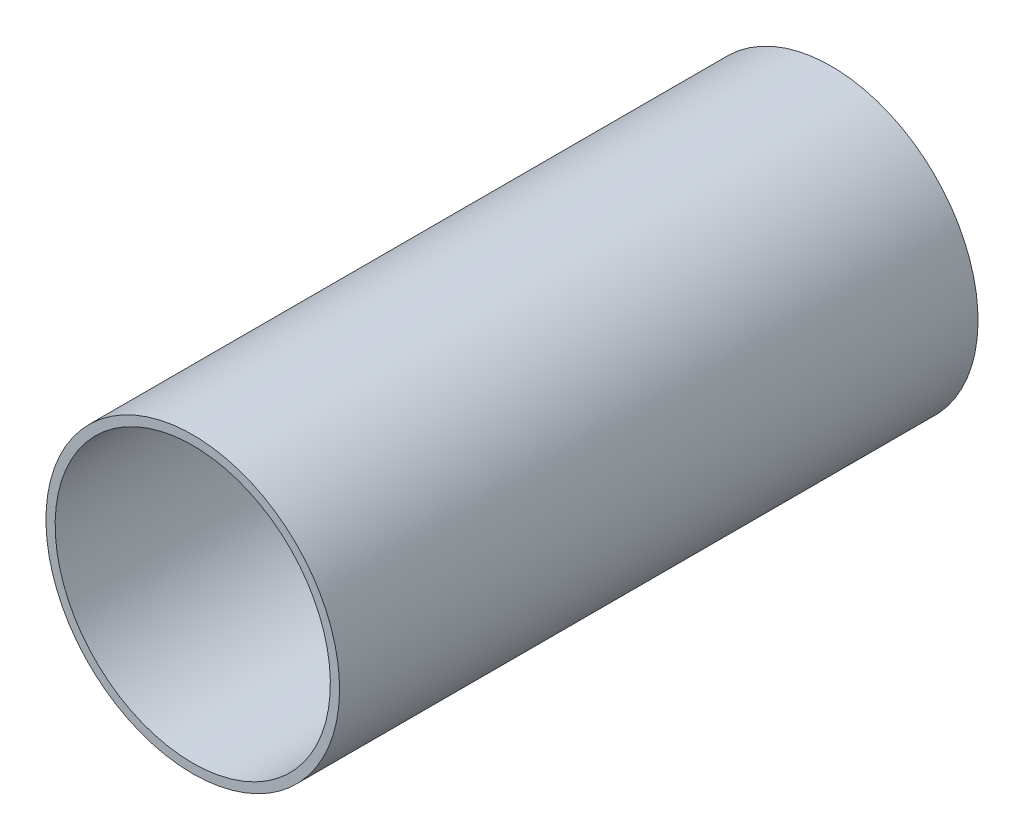
ISO-10303-21;
HEADER;
FILE_DESCRIPTION(('STEP AP214'),'2;1');
FILE_NAME('part.step','',(''),(''),'','','');
FILE_SCHEMA(('AUTOMOTIVE_DESIGN { 1 0 10303 214 1 1 1 1 }'));
ENDSEC;
DATA;
#1=APPLICATION_CONTEXT('core data for automotive mechanical design processes');
#2=APPLICATION_PROTOCOL_DEFINITION('international standard','automotive_design',2000,#1);
#3=PRODUCT_CONTEXT('',#1,'mechanical');
#4=PRODUCT('Part','Part','',(#3));
#5=PRODUCT_RELATED_PRODUCT_CATEGORY('part','',(#4));
#6=PRODUCT_DEFINITION_FORMATION('','',#4);
#7=PRODUCT_DEFINITION_CONTEXT('part definition',#1,'design');
#8=PRODUCT_DEFINITION('design','',#6,#7);
#9=PRODUCT_DEFINITION_SHAPE('','',#8);
#10=(LENGTH_UNIT() NAMED_UNIT(*) SI_UNIT(.MILLI.,.METRE.));
#11=(NAMED_UNIT(*) PLANE_ANGLE_UNIT() SI_UNIT($,.RADIAN.));
#12=(NAMED_UNIT(*) SI_UNIT($,.STERADIAN.) SOLID_ANGLE_UNIT());
#13=UNCERTAINTY_MEASURE_WITH_UNIT(LENGTH_MEASURE(1.E-05),#10,'distance_accuracy_value','');
#14=(GEOMETRIC_REPRESENTATION_CONTEXT(3) GLOBAL_UNCERTAINTY_ASSIGNED_CONTEXT((#13)) GLOBAL_UNIT_ASSIGNED_CONTEXT((#10,
#11,#12)) REPRESENTATION_CONTEXT('',''));
#15=CARTESIAN_POINT('',(0.,0.,0.));
#16=DIRECTION('',(0.,0.,1.));
#17=DIRECTION('',(1.,0.,0.));
#18=AXIS2_PLACEMENT_3D('',#15,#16,#17);
#19=CARTESIAN_POINT('',(124.46,-80.772,-0.045));
#20=DIRECTION('',(0.,0.,-1.));
#21=DIRECTION('',(0.,-1.,0.));
#22=AXIS2_PLACEMENT_3D('',#19,#20,#21);
#23=CYLINDRICAL_SURFACE('',#22,0.375);
#24=CARTESIAN_POINT('',(124.46,-80.772,-0.035));
#25=DIRECTION('',(0.,0.,-1.));
#26=DIRECTION('',(0.,-1.,0.));
#27=AXIS2_PLACEMENT_3D('',#24,#25,#26);
#28=CIRCLE('',#27,0.375);
#29=CARTESIAN_POINT('',(124.46,-81.147,-0.035));
#30=VERTEX_POINT('',#29);
#31=EDGE_CURVE('E66',#30,#30,#28,.T.);
#32=ORIENTED_EDGE('',*,*,#31,.T.);
#33=DIRECTION('',(0.,0.,1.));
#34=VECTOR('',#33,1.);
#35=CARTESIAN_POINT('',(124.46,-81.147,-0.045));
#36=LINE('',#35,#34);
#37=CARTESIAN_POINT('',(124.46,-81.147,1.705));
#38=VERTEX_POINT('',#37);
#39=EDGE_CURVE('E11',#30,#38,#36,.T.);
#40=ORIENTED_EDGE('',*,*,#39,.T.);
#41=CARTESIAN_POINT('',(124.46,-80.772,1.705));
#42=DIRECTION('',(0.,0.,-1.));
#43=DIRECTION('',(0.,-1.,0.));
#44=AXIS2_PLACEMENT_3D('',#41,#42,#43);
#45=CIRCLE('',#44,0.375);
#46=EDGE_CURVE('E21',#38,#38,#45,.T.);
#47=ORIENTED_EDGE('',*,*,#46,.F.);
#48=ORIENTED_EDGE('',*,*,#39,.F.);
#49=EDGE_LOOP('',(#32,#40,#47,#48));
#50=FACE_BOUND('',#49,.T.);
#51=ADVANCED_FACE('F17',(#50),#23,.F.);
#52=CARTESIAN_POINT('',(124.46,-81.172,1.705));
#53=DIRECTION('',(0.,0.,1.));
#54=DIRECTION('',(1.,0.,0.));
#55=AXIS2_PLACEMENT_3D('',#52,#53,#54);
#56=PLANE('',#55);
#57=ORIENTED_EDGE('',*,*,#46,.T.);
#58=EDGE_LOOP('',(#57));
#59=FACE_BOUND('',#58,.T.);
#60=CARTESIAN_POINT('',(124.46,-80.772,1.705));
#61=DIRECTION('',(0.,0.,1.));
#62=DIRECTION('',(0.,-1.,0.));
#63=AXIS2_PLACEMENT_3D('',#60,#61,#62);
#64=CIRCLE('',#63,0.4);
#65=CARTESIAN_POINT('',(124.46,-81.172,1.705));
#66=VERTEX_POINT('',#65);
#67=EDGE_CURVE('E58',#66,#66,#64,.T.);
#68=ORIENTED_EDGE('',*,*,#67,.T.);
#69=EDGE_LOOP('',(#68));
#70=FACE_BOUND('',#69,.T.);
#71=ADVANCED_FACE('F19',(#59,#70),#56,.T.);
#72=CARTESIAN_POINT('',(124.46,-81.172,-0.035));
#73=DIRECTION('',(0.,0.,1.));
#74=DIRECTION('',(1.,0.,0.));
#75=AXIS2_PLACEMENT_3D('',#72,#73,#74);
#76=PLANE('',#75);
#77=ORIENTED_EDGE('',*,*,#31,.F.);
#78=EDGE_LOOP('',(#77));
#79=FACE_BOUND('',#78,.T.);
#80=CARTESIAN_POINT('',(124.46,-80.772,-0.035));
#81=DIRECTION('',(0.,0.,1.));
#82=DIRECTION('',(0.,-1.,0.));
#83=AXIS2_PLACEMENT_3D('',#80,#81,#82);
#84=CIRCLE('',#83,0.4);
#85=CARTESIAN_POINT('',(124.46,-81.172,-0.035));
#86=VERTEX_POINT('',#85);
#87=EDGE_CURVE('E57',#86,#86,#84,.T.);
#88=ORIENTED_EDGE('',*,*,#87,.F.);
#89=EDGE_LOOP('',(#88));
#90=FACE_BOUND('',#89,.T.);
#91=ADVANCED_FACE('F85',(#79,#90),#76,.F.);
#92=CARTESIAN_POINT('',(124.46,-80.772,-0.035));
#93=DIRECTION('',(0.,0.,-1.));
#94=DIRECTION('',(0.,-1.,0.));
#95=AXIS2_PLACEMENT_3D('',#92,#93,#94);
#96=CYLINDRICAL_SURFACE('',#95,0.4);
#97=ORIENTED_EDGE('',*,*,#87,.T.);
#98=DIRECTION('',(0.,0.,1.));
#99=VECTOR('',#98,1.);
#100=CARTESIAN_POINT('',(124.46,-81.172,-0.035));
#101=LINE('',#100,#99);
#102=EDGE_CURVE('E54',#86,#66,#101,.T.);
#103=ORIENTED_EDGE('',*,*,#102,.T.);
#104=ORIENTED_EDGE('',*,*,#67,.F.);
#105=ORIENTED_EDGE('',*,*,#102,.F.);
#106=EDGE_LOOP('',(#97,#103,#104,#105));
#107=FACE_BOUND('',#106,.T.);
#108=ADVANCED_FACE('F55',(#107),#96,.T.);
#109=CLOSED_SHELL('',(#51,#71,#91,#108));
#110=MANIFOLD_SOLID_BREP('B1',#109);
#111=ADVANCED_BREP_SHAPE_REPRESENTATION('',(#18,#110),#14);
#112=SHAPE_DEFINITION_REPRESENTATION(#9,#111);
ENDSEC;
END-ISO-10303-21;
